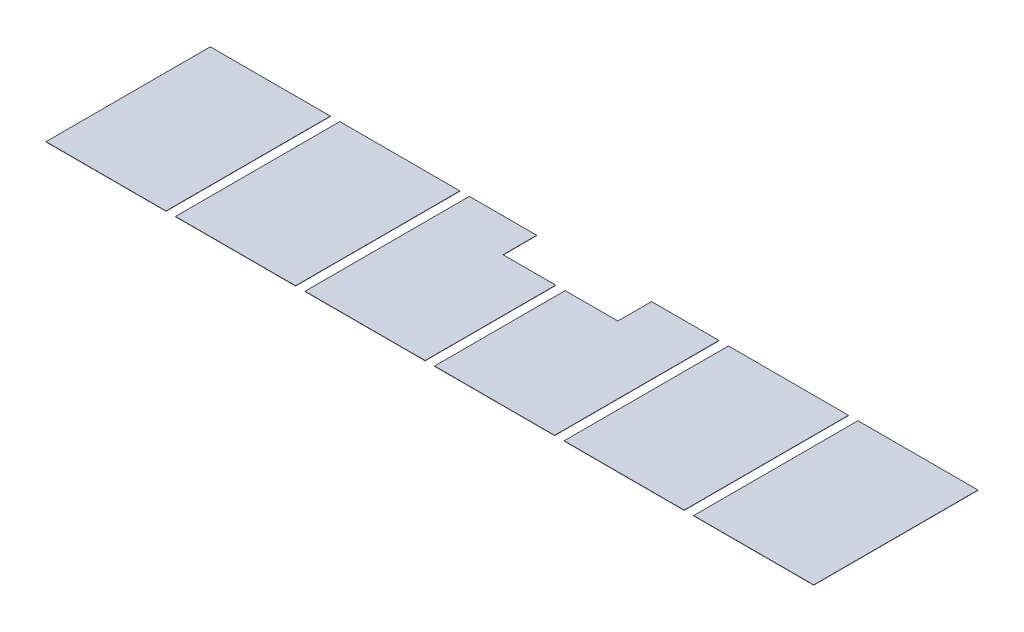
ISO-10303-21;
HEADER;
FILE_DESCRIPTION(('STEP AP214'),'2;1');
FILE_NAME('part.step','',(''),(''),'','','');
FILE_SCHEMA(('AUTOMOTIVE_DESIGN { 1 0 10303 214 1 1 1 1 }'));
ENDSEC;
DATA;
#1=APPLICATION_CONTEXT('core data for automotive mechanical design processes');
#2=APPLICATION_PROTOCOL_DEFINITION('international standard','automotive_design',2000,#1);
#3=PRODUCT_CONTEXT('',#1,'mechanical');
#4=PRODUCT('Part','Part','',(#3));
#5=PRODUCT_RELATED_PRODUCT_CATEGORY('part','',(#4));
#6=PRODUCT_DEFINITION_FORMATION('','',#4);
#7=PRODUCT_DEFINITION_CONTEXT('part definition',#1,'design');
#8=PRODUCT_DEFINITION('design','',#6,#7);
#9=PRODUCT_DEFINITION_SHAPE('','',#8);
#10=(LENGTH_UNIT() NAMED_UNIT(*) SI_UNIT(.MILLI.,.METRE.));
#11=(NAMED_UNIT(*) PLANE_ANGLE_UNIT() SI_UNIT($,.RADIAN.));
#12=(NAMED_UNIT(*) SI_UNIT($,.STERADIAN.) SOLID_ANGLE_UNIT());
#13=UNCERTAINTY_MEASURE_WITH_UNIT(LENGTH_MEASURE(1.E-05),#10,'distance_accuracy_value','');
#14=(GEOMETRIC_REPRESENTATION_CONTEXT(3) GLOBAL_UNCERTAINTY_ASSIGNED_CONTEXT((#13)) GLOBAL_UNIT_ASSIGNED_CONTEXT((#10,
#11,#12)) REPRESENTATION_CONTEXT('',''));
#15=CARTESIAN_POINT('',(0.,0.,0.));
#16=DIRECTION('',(0.,0.,1.));
#17=DIRECTION('',(1.,0.,0.));
#18=AXIS2_PLACEMENT_3D('',#15,#16,#17);
#19=CARTESIAN_POINT('',(4000.5,2497.64430946714,-2044.7));
#20=DIRECTION('',(0.,0.,1.));
#21=DIRECTION('',(1.,0.,0.));
#22=AXIS2_PLACEMENT_3D('',#19,#20,#21);
#23=PLANE('',#22);
#24=DIRECTION('',(-1.,0.,0.));
#25=VECTOR('',#24,1.);
#26=CARTESIAN_POINT('',(4000.5,43.8149999999999,-2044.7));
#27=LINE('',#26,#25);
#28=CARTESIAN_POINT('',(4000.5,43.8149999999999,-2044.7));
#29=VERTEX_POINT('',#28);
#30=CARTESIAN_POINT('',(3187.7,43.8149999999999,-2044.7));
#31=VERTEX_POINT('',#30);
#32=EDGE_CURVE('E126',#29,#31,#27,.T.);
#33=ORIENTED_EDGE('',*,*,#32,.F.);
#34=DIRECTION('',(0.,-1.,0.));
#35=VECTOR('',#34,1.);
#36=CARTESIAN_POINT('',(4000.5,2497.64430946714,-2044.7));
#37=LINE('',#36,#35);
#38=CARTESIAN_POINT('',(4000.5,40.64,-2044.7));
#39=VERTEX_POINT('',#38);
#40=EDGE_CURVE('E49',#29,#39,#37,.T.);
#41=ORIENTED_EDGE('',*,*,#40,.T.);
#42=DIRECTION('',(-1.,0.,0.));
#43=VECTOR('',#42,1.);
#44=CARTESIAN_POINT('',(4000.5,40.64,-2044.7));
#45=LINE('',#44,#43);
#46=CARTESIAN_POINT('',(3187.7,40.64,-2044.7));
#47=VERTEX_POINT('',#46);
#48=EDGE_CURVE('E134',#39,#47,#45,.T.);
#49=ORIENTED_EDGE('',*,*,#48,.T.);
#50=DIRECTION('',(0.,-1.,0.));
#51=VECTOR('',#50,1.);
#52=CARTESIAN_POINT('',(3187.7,2497.64430946714,-2044.7));
#53=LINE('',#52,#51);
#54=EDGE_CURVE('E92',#31,#47,#53,.T.);
#55=ORIENTED_EDGE('',*,*,#54,.F.);
#56=EDGE_LOOP('',(#33,#41,#49,#55));
#57=FACE_BOUND('',#56,.T.);
#58=ADVANCED_FACE('F45',(#57),#23,.F.);
#59=CARTESIAN_POINT('',(3187.7,2497.64430946714,-2044.7));
#60=DIRECTION('',(1.,0.,0.));
#61=DIRECTION('',(0.,0.,-1.));
#62=AXIS2_PLACEMENT_3D('',#59,#60,#61);
#63=PLANE('',#62);
#64=DIRECTION('',(0.,0.,1.));
#65=VECTOR('',#64,1.);
#66=CARTESIAN_POINT('',(3187.7,43.8149999999999,-2044.7));
#67=LINE('',#66,#65);
#68=CARTESIAN_POINT('',(3187.7,43.8149999999999,-63.5000000000028));
#69=VERTEX_POINT('',#68);
#70=EDGE_CURVE('E99',#31,#69,#67,.T.);
#71=ORIENTED_EDGE('',*,*,#70,.F.);
#72=ORIENTED_EDGE('',*,*,#54,.T.);
#73=DIRECTION('',(0.,0.,1.));
#74=VECTOR('',#73,1.);
#75=CARTESIAN_POINT('',(3187.7,40.64,-2044.7));
#76=LINE('',#75,#74);
#77=CARTESIAN_POINT('',(3187.7,40.64,-63.5000000000028));
#78=VERTEX_POINT('',#77);
#79=EDGE_CURVE('E133',#47,#78,#76,.T.);
#80=ORIENTED_EDGE('',*,*,#79,.T.);
#81=DIRECTION('',(0.,-1.,0.));
#82=VECTOR('',#81,1.);
#83=CARTESIAN_POINT('',(3187.7,2497.64430946714,-63.5000000000028));
#84=LINE('',#83,#82);
#85=EDGE_CURVE('E135',#69,#78,#84,.T.);
#86=ORIENTED_EDGE('',*,*,#85,.F.);
#87=EDGE_LOOP('',(#71,#72,#80,#86));
#88=FACE_BOUND('',#87,.T.);
#89=ADVANCED_FACE('F153',(#88),#63,.F.);
#90=CARTESIAN_POINT('',(3187.7,2497.64430946714,-63.5000000000028));
#91=DIRECTION('',(0.,0.,-1.));
#92=DIRECTION('',(-1.,0.,0.));
#93=AXIS2_PLACEMENT_3D('',#90,#91,#92);
#94=PLANE('',#93);
#95=DIRECTION('',(1.,0.,0.));
#96=VECTOR('',#95,1.);
#97=CARTESIAN_POINT('',(3187.7,43.8149999999999,-63.5000000000028));
#98=LINE('',#97,#96);
#99=CARTESIAN_POINT('',(4635.5,43.8149999999999,-63.5000000000028));
#100=VERTEX_POINT('',#99);
#101=EDGE_CURVE('E120',#69,#100,#98,.T.);
#102=ORIENTED_EDGE('',*,*,#101,.F.);
#103=ORIENTED_EDGE('',*,*,#85,.T.);
#104=DIRECTION('',(1.,0.,0.));
#105=VECTOR('',#104,1.);
#106=CARTESIAN_POINT('',(3187.7,40.64,-63.5000000000028));
#107=LINE('',#106,#105);
#108=CARTESIAN_POINT('',(4635.5,40.64,-63.5000000000028));
#109=VERTEX_POINT('',#108);
#110=EDGE_CURVE('E137',#78,#109,#107,.T.);
#111=ORIENTED_EDGE('',*,*,#110,.T.);
#112=DIRECTION('',(0.,-1.,0.));
#113=VECTOR('',#112,1.);
#114=CARTESIAN_POINT('',(4635.5,2497.64430946714,-63.5000000000028));
#115=LINE('',#114,#113);
#116=EDGE_CURVE('E138',#100,#109,#115,.T.);
#117=ORIENTED_EDGE('',*,*,#116,.F.);
#118=EDGE_LOOP('',(#102,#103,#111,#117));
#119=FACE_BOUND('',#118,.T.);
#120=ADVANCED_FACE('F155',(#119),#94,.F.);
#121=CARTESIAN_POINT('',(4635.5,2497.64430946714,-63.5000000000028));
#122=DIRECTION('',(-1.,0.,0.));
#123=DIRECTION('',(0.,0.,1.));
#124=AXIS2_PLACEMENT_3D('',#121,#122,#123);
#125=PLANE('',#124);
#126=DIRECTION('',(0.,0.,-1.));
#127=VECTOR('',#126,1.);
#128=CARTESIAN_POINT('',(4635.5,43.8149999999999,-63.5000000000028));
#129=LINE('',#128,#127);
#130=CARTESIAN_POINT('',(4635.5,43.8149999999999,-1638.3));
#131=VERTEX_POINT('',#130);
#132=EDGE_CURVE('E54',#100,#131,#129,.T.);
#133=ORIENTED_EDGE('',*,*,#132,.F.);
#134=ORIENTED_EDGE('',*,*,#116,.T.);
#135=DIRECTION('',(0.,0.,-1.));
#136=VECTOR('',#135,1.);
#137=CARTESIAN_POINT('',(4635.5,40.64,-63.5000000000028));
#138=LINE('',#137,#136);
#139=CARTESIAN_POINT('',(4635.5,40.64,-1638.3));
#140=VERTEX_POINT('',#139);
#141=EDGE_CURVE('E115',#109,#140,#138,.T.);
#142=ORIENTED_EDGE('',*,*,#141,.T.);
#143=DIRECTION('',(0.,-1.,0.));
#144=VECTOR('',#143,1.);
#145=CARTESIAN_POINT('',(4635.5,2497.64430946714,-1638.3));
#146=LINE('',#145,#144);
#147=EDGE_CURVE('E106',#131,#140,#146,.T.);
#148=ORIENTED_EDGE('',*,*,#147,.F.);
#149=EDGE_LOOP('',(#133,#134,#142,#148));
#150=FACE_BOUND('',#149,.T.);
#151=ADVANCED_FACE('F112',(#150),#125,.F.);
#152=CARTESIAN_POINT('',(4635.5,2497.64430946714,-1638.3));
#153=DIRECTION('',(0.,0.,1.));
#154=DIRECTION('',(1.,0.,0.));
#155=AXIS2_PLACEMENT_3D('',#152,#153,#154);
#156=PLANE('',#155);
#157=DIRECTION('',(-1.,0.,0.));
#158=VECTOR('',#157,1.);
#159=CARTESIAN_POINT('',(4635.5,43.8149999999999,-1638.3));
#160=LINE('',#159,#158);
#161=CARTESIAN_POINT('',(4000.5,43.8149999999999,-1638.3));
#162=VERTEX_POINT('',#161);
#163=EDGE_CURVE('E12',#131,#162,#160,.T.);
#164=ORIENTED_EDGE('',*,*,#163,.F.);
#165=ORIENTED_EDGE('',*,*,#147,.T.);
#166=DIRECTION('',(-1.,0.,0.));
#167=VECTOR('',#166,1.);
#168=CARTESIAN_POINT('',(4635.5,40.64,-1638.3));
#169=LINE('',#168,#167);
#170=CARTESIAN_POINT('',(4000.5,40.64,-1638.3));
#171=VERTEX_POINT('',#170);
#172=EDGE_CURVE('E117',#140,#171,#169,.T.);
#173=ORIENTED_EDGE('',*,*,#172,.T.);
#174=DIRECTION('',(0.,-1.,0.));
#175=VECTOR('',#174,1.);
#176=CARTESIAN_POINT('',(4000.5,2497.64430946714,-1638.3));
#177=LINE('',#176,#175);
#178=EDGE_CURVE('E67',#162,#171,#177,.T.);
#179=ORIENTED_EDGE('',*,*,#178,.F.);
#180=EDGE_LOOP('',(#164,#165,#173,#179));
#181=FACE_BOUND('',#180,.T.);
#182=ADVANCED_FACE('F105',(#181),#156,.F.);
#183=CARTESIAN_POINT('',(4000.5,2497.64430946714,-1638.3));
#184=DIRECTION('',(-1.,0.,0.));
#185=DIRECTION('',(0.,0.,1.));
#186=AXIS2_PLACEMENT_3D('',#183,#184,#185);
#187=PLANE('',#186);
#188=DIRECTION('',(0.,0.,-1.));
#189=VECTOR('',#188,1.);
#190=CARTESIAN_POINT('',(4000.5,43.8149999999999,-1638.3));
#191=LINE('',#190,#189);
#192=EDGE_CURVE('E129',#162,#29,#191,.T.);
#193=ORIENTED_EDGE('',*,*,#192,.F.);
#194=ORIENTED_EDGE('',*,*,#178,.T.);
#195=DIRECTION('',(0.,0.,-1.));
#196=VECTOR('',#195,1.);
#197=CARTESIAN_POINT('',(4000.5,40.64,-1638.3));
#198=LINE('',#197,#196);
#199=EDGE_CURVE('E131',#171,#39,#198,.T.);
#200=ORIENTED_EDGE('',*,*,#199,.T.);
#201=ORIENTED_EDGE('',*,*,#40,.F.);
#202=EDGE_LOOP('',(#193,#194,#200,#201));
#203=FACE_BOUND('',#202,.T.);
#204=ADVANCED_FACE('F149',(#203),#187,.F.);
#205=CARTESIAN_POINT('',(0.,40.64,0.));
#206=DIRECTION('',(0.,1.,0.));
#207=DIRECTION('',(0.,0.,1.));
#208=AXIS2_PLACEMENT_3D('',#205,#206,#207);
#209=PLANE('',#208);
#210=ORIENTED_EDGE('',*,*,#48,.F.);
#211=ORIENTED_EDGE('',*,*,#199,.F.);
#212=ORIENTED_EDGE('',*,*,#172,.F.);
#213=ORIENTED_EDGE('',*,*,#141,.F.);
#214=ORIENTED_EDGE('',*,*,#110,.F.);
#215=ORIENTED_EDGE('',*,*,#79,.F.);
#216=EDGE_LOOP('',(#210,#211,#212,#213,#214,#215));
#217=FACE_BOUND('',#216,.T.);
#218=ADVANCED_FACE('F151',(#217),#209,.F.);
#219=CARTESIAN_POINT('',(0.,43.815,0.));
#220=DIRECTION('',(0.,1.,0.));
#221=DIRECTION('',(0.,0.,1.));
#222=AXIS2_PLACEMENT_3D('',#219,#220,#221);
#223=PLANE('',#222);
#224=ORIENTED_EDGE('',*,*,#192,.T.);
#225=ORIENTED_EDGE('',*,*,#32,.T.);
#226=ORIENTED_EDGE('',*,*,#70,.T.);
#227=ORIENTED_EDGE('',*,*,#101,.T.);
#228=ORIENTED_EDGE('',*,*,#132,.T.);
#229=ORIENTED_EDGE('',*,*,#163,.T.);
#230=EDGE_LOOP('',(#224,#225,#226,#227,#228,#229));
#231=FACE_BOUND('',#230,.T.);
#232=ADVANCED_FACE('F47',(#231),#223,.T.);
#233=CLOSED_SHELL('',(#58,#89,#120,#151,#182,#204,#218,#232));
#234=MANIFOLD_SOLID_BREP('B2',#233);
#235=CARTESIAN_POINT('',(6197.6,2497.64430946714,-63.5000000000028));
#236=DIRECTION('',(-1.,0.,0.));
#237=DIRECTION('',(0.,0.,1.));
#238=AXIS2_PLACEMENT_3D('',#235,#236,#237);
#239=PLANE('',#238);
#240=DIRECTION('',(0.,0.,-1.));
#241=VECTOR('',#240,1.);
#242=CARTESIAN_POINT('',(6197.6,43.8149999999999,-63.5000000000028));
#243=LINE('',#242,#241);
#244=CARTESIAN_POINT('',(6197.6,43.8149999999999,-63.5000000000028));
#245=VERTEX_POINT('',#244);
#246=CARTESIAN_POINT('',(6197.6,43.8149999999999,-2044.7));
#247=VERTEX_POINT('',#246);
#248=EDGE_CURVE('E311',#245,#247,#243,.T.);
#249=ORIENTED_EDGE('',*,*,#248,.F.);
#250=DIRECTION('',(0.,-1.,0.));
#251=VECTOR('',#250,1.);
#252=CARTESIAN_POINT('',(6197.6,2497.64430946714,-63.5000000000028));
#253=LINE('',#252,#251);
#254=CARTESIAN_POINT('',(6197.6,40.64,-63.5000000000028));
#255=VERTEX_POINT('',#254);
#256=EDGE_CURVE('E234',#245,#255,#253,.T.);
#257=ORIENTED_EDGE('',*,*,#256,.T.);
#258=DIRECTION('',(0.,0.,-1.));
#259=VECTOR('',#258,1.);
#260=CARTESIAN_POINT('',(6197.6,40.64,-63.5000000000028));
#261=LINE('',#260,#259);
#262=CARTESIAN_POINT('',(6197.6,40.64,-2044.7));
#263=VERTEX_POINT('',#262);
#264=EDGE_CURVE('E319',#255,#263,#261,.T.);
#265=ORIENTED_EDGE('',*,*,#264,.T.);
#266=DIRECTION('',(0.,-1.,0.));
#267=VECTOR('',#266,1.);
#268=CARTESIAN_POINT('',(6197.6,2497.64430946714,-2044.7));
#269=LINE('',#268,#267);
#270=EDGE_CURVE('E277',#247,#263,#269,.T.);
#271=ORIENTED_EDGE('',*,*,#270,.F.);
#272=EDGE_LOOP('',(#249,#257,#265,#271));
#273=FACE_BOUND('',#272,.T.);
#274=ADVANCED_FACE('F230',(#273),#239,.F.);
#275=CARTESIAN_POINT('',(6197.6,2497.64430946714,-2044.7));
#276=DIRECTION('',(0.,0.,1.));
#277=DIRECTION('',(1.,0.,0.));
#278=AXIS2_PLACEMENT_3D('',#275,#276,#277);
#279=PLANE('',#278);
#280=DIRECTION('',(-1.,0.,0.));
#281=VECTOR('',#280,1.);
#282=CARTESIAN_POINT('',(6197.6,43.8149999999999,-2044.7));
#283=LINE('',#282,#281);
#284=CARTESIAN_POINT('',(5384.8,43.8149999999999,-2044.7));
#285=VERTEX_POINT('',#284);
#286=EDGE_CURVE('E284',#247,#285,#283,.T.);
#287=ORIENTED_EDGE('',*,*,#286,.F.);
#288=ORIENTED_EDGE('',*,*,#270,.T.);
#289=DIRECTION('',(-1.,0.,0.));
#290=VECTOR('',#289,1.);
#291=CARTESIAN_POINT('',(6197.6,40.64,-2044.7));
#292=LINE('',#291,#290);
#293=CARTESIAN_POINT('',(5384.8,40.64,-2044.7));
#294=VERTEX_POINT('',#293);
#295=EDGE_CURVE('E318',#263,#294,#292,.T.);
#296=ORIENTED_EDGE('',*,*,#295,.T.);
#297=DIRECTION('',(0.,-1.,0.));
#298=VECTOR('',#297,1.);
#299=CARTESIAN_POINT('',(5384.8,2497.64430946714,-2044.7));
#300=LINE('',#299,#298);
#301=EDGE_CURVE('E320',#285,#294,#300,.T.);
#302=ORIENTED_EDGE('',*,*,#301,.F.);
#303=EDGE_LOOP('',(#287,#288,#296,#302));
#304=FACE_BOUND('',#303,.T.);
#305=ADVANCED_FACE('F338',(#304),#279,.F.);
#306=CARTESIAN_POINT('',(5384.8,2497.64430946714,-2044.7));
#307=DIRECTION('',(1.,0.,0.));
#308=DIRECTION('',(0.,0.,-1.));
#309=AXIS2_PLACEMENT_3D('',#306,#307,#308);
#310=PLANE('',#309);
#311=DIRECTION('',(0.,0.,1.));
#312=VECTOR('',#311,1.);
#313=CARTESIAN_POINT('',(5384.8,43.8149999999999,-2044.7));
#314=LINE('',#313,#312);
#315=CARTESIAN_POINT('',(5384.8,43.8149999999999,-1638.3));
#316=VERTEX_POINT('',#315);
#317=EDGE_CURVE('E305',#285,#316,#314,.T.);
#318=ORIENTED_EDGE('',*,*,#317,.F.);
#319=ORIENTED_EDGE('',*,*,#301,.T.);
#320=DIRECTION('',(0.,0.,1.));
#321=VECTOR('',#320,1.);
#322=CARTESIAN_POINT('',(5384.8,40.64,-2044.7));
#323=LINE('',#322,#321);
#324=CARTESIAN_POINT('',(5384.8,40.64,-1638.3));
#325=VERTEX_POINT('',#324);
#326=EDGE_CURVE('E322',#294,#325,#323,.T.);
#327=ORIENTED_EDGE('',*,*,#326,.T.);
#328=DIRECTION('',(0.,-1.,0.));
#329=VECTOR('',#328,1.);
#330=CARTESIAN_POINT('',(5384.8,2497.64430946714,-1638.3));
#331=LINE('',#330,#329);
#332=EDGE_CURVE('E323',#316,#325,#331,.T.);
#333=ORIENTED_EDGE('',*,*,#332,.F.);
#334=EDGE_LOOP('',(#318,#319,#327,#333));
#335=FACE_BOUND('',#334,.T.);
#336=ADVANCED_FACE('F340',(#335),#310,.F.);
#337=CARTESIAN_POINT('',(5384.8,2497.64430946714,-1638.3));
#338=DIRECTION('',(0.,0.,1.));
#339=DIRECTION('',(1.,0.,0.));
#340=AXIS2_PLACEMENT_3D('',#337,#338,#339);
#341=PLANE('',#340);
#342=DIRECTION('',(-1.,0.,0.));
#343=VECTOR('',#342,1.);
#344=CARTESIAN_POINT('',(5384.8,43.8149999999999,-1638.3));
#345=LINE('',#344,#343);
#346=CARTESIAN_POINT('',(4749.8,43.8149999999999,-1638.3));
#347=VERTEX_POINT('',#346);
#348=EDGE_CURVE('E239',#316,#347,#345,.T.);
#349=ORIENTED_EDGE('',*,*,#348,.F.);
#350=ORIENTED_EDGE('',*,*,#332,.T.);
#351=DIRECTION('',(-1.,0.,0.));
#352=VECTOR('',#351,1.);
#353=CARTESIAN_POINT('',(5384.8,40.64,-1638.3));
#354=LINE('',#353,#352);
#355=CARTESIAN_POINT('',(4749.8,40.64,-1638.3));
#356=VERTEX_POINT('',#355);
#357=EDGE_CURVE('E300',#325,#356,#354,.T.);
#358=ORIENTED_EDGE('',*,*,#357,.T.);
#359=DIRECTION('',(0.,-1.,0.));
#360=VECTOR('',#359,1.);
#361=CARTESIAN_POINT('',(4749.8,2497.64430946714,-1638.3));
#362=LINE('',#361,#360);
#363=EDGE_CURVE('E291',#347,#356,#362,.T.);
#364=ORIENTED_EDGE('',*,*,#363,.F.);
#365=EDGE_LOOP('',(#349,#350,#358,#364));
#366=FACE_BOUND('',#365,.T.);
#367=ADVANCED_FACE('F297',(#366),#341,.F.);
#368=CARTESIAN_POINT('',(4749.8,2497.64430946714,-1638.3));
#369=DIRECTION('',(1.,0.,0.));
#370=DIRECTION('',(0.,0.,-1.));
#371=AXIS2_PLACEMENT_3D('',#368,#369,#370);
#372=PLANE('',#371);
#373=DIRECTION('',(0.,0.,1.));
#374=VECTOR('',#373,1.);
#375=CARTESIAN_POINT('',(4749.8,43.8149999999999,-1638.3));
#376=LINE('',#375,#374);
#377=CARTESIAN_POINT('',(4749.8,43.8149999999999,-63.5000000000028));
#378=VERTEX_POINT('',#377);
#379=EDGE_CURVE('E43',#347,#378,#376,.T.);
#380=ORIENTED_EDGE('',*,*,#379,.F.);
#381=ORIENTED_EDGE('',*,*,#363,.T.);
#382=DIRECTION('',(0.,0.,1.));
#383=VECTOR('',#382,1.);
#384=CARTESIAN_POINT('',(4749.8,40.64,-1638.3));
#385=LINE('',#384,#383);
#386=CARTESIAN_POINT('',(4749.8,40.64,-63.5000000000028));
#387=VERTEX_POINT('',#386);
#388=EDGE_CURVE('E302',#356,#387,#385,.T.);
#389=ORIENTED_EDGE('',*,*,#388,.T.);
#390=DIRECTION('',(0.,-1.,0.));
#391=VECTOR('',#390,1.);
#392=CARTESIAN_POINT('',(4749.8,2497.64430946714,-63.5000000000028));
#393=LINE('',#392,#391);
#394=EDGE_CURVE('E252',#378,#387,#393,.T.);
#395=ORIENTED_EDGE('',*,*,#394,.F.);
#396=EDGE_LOOP('',(#380,#381,#389,#395));
#397=FACE_BOUND('',#396,.T.);
#398=ADVANCED_FACE('F290',(#397),#372,.F.);
#399=CARTESIAN_POINT('',(4749.8,2497.64430946714,-63.5000000000028));
#400=DIRECTION('',(0.,0.,-1.));
#401=DIRECTION('',(-1.,0.,0.));
#402=AXIS2_PLACEMENT_3D('',#399,#400,#401);
#403=PLANE('',#402);
#404=DIRECTION('',(1.,0.,0.));
#405=VECTOR('',#404,1.);
#406=CARTESIAN_POINT('',(4749.8,43.8149999999999,-63.5000000000028));
#407=LINE('',#406,#405);
#408=EDGE_CURVE('E314',#378,#245,#407,.T.);
#409=ORIENTED_EDGE('',*,*,#408,.F.);
#410=ORIENTED_EDGE('',*,*,#394,.T.);
#411=DIRECTION('',(1.,0.,0.));
#412=VECTOR('',#411,1.);
#413=CARTESIAN_POINT('',(4749.8,40.64,-63.5000000000028));
#414=LINE('',#413,#412);
#415=EDGE_CURVE('E316',#387,#255,#414,.T.);
#416=ORIENTED_EDGE('',*,*,#415,.T.);
#417=ORIENTED_EDGE('',*,*,#256,.F.);
#418=EDGE_LOOP('',(#409,#410,#416,#417));
#419=FACE_BOUND('',#418,.T.);
#420=ADVANCED_FACE('F334',(#419),#403,.F.);
#421=CARTESIAN_POINT('',(0.,40.64,0.));
#422=DIRECTION('',(0.,1.,0.));
#423=DIRECTION('',(0.,0.,1.));
#424=AXIS2_PLACEMENT_3D('',#421,#422,#423);
#425=PLANE('',#424);
#426=ORIENTED_EDGE('',*,*,#264,.F.);
#427=ORIENTED_EDGE('',*,*,#415,.F.);
#428=ORIENTED_EDGE('',*,*,#388,.F.);
#429=ORIENTED_EDGE('',*,*,#357,.F.);
#430=ORIENTED_EDGE('',*,*,#326,.F.);
#431=ORIENTED_EDGE('',*,*,#295,.F.);
#432=EDGE_LOOP('',(#426,#427,#428,#429,#430,#431));
#433=FACE_BOUND('',#432,.T.);
#434=ADVANCED_FACE('F336',(#433),#425,.F.);
#435=CARTESIAN_POINT('',(0.,43.815,0.));
#436=DIRECTION('',(0.,1.,0.));
#437=DIRECTION('',(0.,0.,1.));
#438=AXIS2_PLACEMENT_3D('',#435,#436,#437);
#439=PLANE('',#438);
#440=ORIENTED_EDGE('',*,*,#408,.T.);
#441=ORIENTED_EDGE('',*,*,#248,.T.);
#442=ORIENTED_EDGE('',*,*,#286,.T.);
#443=ORIENTED_EDGE('',*,*,#317,.T.);
#444=ORIENTED_EDGE('',*,*,#348,.T.);
#445=ORIENTED_EDGE('',*,*,#379,.T.);
#446=EDGE_LOOP('',(#440,#441,#442,#443,#444,#445));
#447=FACE_BOUND('',#446,.T.);
#448=ADVANCED_FACE('F232',(#447),#439,.T.);
#449=CLOSED_SHELL('',(#274,#305,#336,#367,#398,#420,#434,#448));
#450=MANIFOLD_SOLID_BREP('B6',#449);
#451=CARTESIAN_POINT('',(6311.9,2497.64430946714,-63.5000000000028));
#452=DIRECTION('',(0.,0.,-1.));
#453=DIRECTION('',(-1.,0.,0.));
#454=AXIS2_PLACEMENT_3D('',#451,#452,#453);
#455=PLANE('',#454);
#456=DIRECTION('',(1.,0.,0.));
#457=VECTOR('',#456,1.);
#458=CARTESIAN_POINT('',(6311.9,43.8149999999999,-63.5000000000028));
#459=LINE('',#458,#457);
#460=CARTESIAN_POINT('',(6311.9,43.8149999999999,-63.5000000000028));
#461=VERTEX_POINT('',#460);
#462=CARTESIAN_POINT('',(7759.7,43.8149999999999,-63.5000000000028));
#463=VERTEX_POINT('',#462);
#464=EDGE_CURVE('E465',#461,#463,#459,.T.);
#465=ORIENTED_EDGE('',*,*,#464,.F.);
#466=DIRECTION('',(0.,-1.,0.));
#467=VECTOR('',#466,1.);
#468=CARTESIAN_POINT('',(6311.9,2497.64430946714,-63.5000000000028));
#469=LINE('',#468,#467);
#470=CARTESIAN_POINT('',(6311.9,40.64,-63.5000000000028));
#471=VERTEX_POINT('',#470);
#472=EDGE_CURVE('E419',#461,#471,#469,.T.);
#473=ORIENTED_EDGE('',*,*,#472,.T.);
#474=DIRECTION('',(1.,0.,0.));
#475=VECTOR('',#474,1.);
#476=CARTESIAN_POINT('',(6311.9,40.64,-63.5000000000028));
#477=LINE('',#476,#475);
#478=CARTESIAN_POINT('',(7759.7,40.64,-63.5000000000028));
#479=VERTEX_POINT('',#478);
#480=EDGE_CURVE('E463',#471,#479,#477,.T.);
#481=ORIENTED_EDGE('',*,*,#480,.T.);
#482=DIRECTION('',(0.,-1.,0.));
#483=VECTOR('',#482,1.);
#484=CARTESIAN_POINT('',(7759.7,2497.64430946714,-63.5000000000028));
#485=LINE('',#484,#483);
#486=EDGE_CURVE('E454',#463,#479,#485,.T.);
#487=ORIENTED_EDGE('',*,*,#486,.F.);
#488=EDGE_LOOP('',(#465,#473,#481,#487));
#489=FACE_BOUND('',#488,.T.);
#490=ADVANCED_FACE('F415',(#489),#455,.F.);
#491=CARTESIAN_POINT('',(7759.7,2497.64430946714,-63.5000000000028));
#492=DIRECTION('',(-1.,0.,0.));
#493=DIRECTION('',(0.,0.,1.));
#494=AXIS2_PLACEMENT_3D('',#491,#492,#493);
#495=PLANE('',#494);
#496=DIRECTION('',(0.,0.,-1.));
#497=VECTOR('',#496,1.);
#498=CARTESIAN_POINT('',(7759.7,43.8149999999999,-63.5000000000028));
#499=LINE('',#498,#497);
#500=CARTESIAN_POINT('',(7759.7,43.8149999999999,-2044.7));
#501=VERTEX_POINT('',#500);
#502=EDGE_CURVE('E424',#463,#501,#499,.T.);
#503=ORIENTED_EDGE('',*,*,#502,.F.);
#504=ORIENTED_EDGE('',*,*,#486,.T.);
#505=DIRECTION('',(0.,0.,-1.));
#506=VECTOR('',#505,1.);
#507=CARTESIAN_POINT('',(7759.7,40.64,-63.5000000000028));
#508=LINE('',#507,#506);
#509=CARTESIAN_POINT('',(7759.7,40.64,-2044.7));
#510=VERTEX_POINT('',#509);
#511=EDGE_CURVE('E475',#479,#510,#508,.T.);
#512=ORIENTED_EDGE('',*,*,#511,.T.);
#513=DIRECTION('',(0.,-1.,0.));
#514=VECTOR('',#513,1.);
#515=CARTESIAN_POINT('',(7759.7,2497.64430946714,-2044.7));
#516=LINE('',#515,#514);
#517=EDGE_CURVE('E484',#501,#510,#516,.T.);
#518=ORIENTED_EDGE('',*,*,#517,.F.);
#519=EDGE_LOOP('',(#503,#504,#512,#518));
#520=FACE_BOUND('',#519,.T.);
#521=ADVANCED_FACE('F488',(#520),#495,.F.);
#522=CARTESIAN_POINT('',(7759.7,2497.64430946714,-2044.7));
#523=DIRECTION('',(0.,0.,1.));
#524=DIRECTION('',(1.,0.,0.));
#525=AXIS2_PLACEMENT_3D('',#522,#523,#524);
#526=PLANE('',#525);
#527=DIRECTION('',(-1.,0.,0.));
#528=VECTOR('',#527,1.);
#529=CARTESIAN_POINT('',(7759.7,43.8149999999999,-2044.7));
#530=LINE('',#529,#528);
#531=CARTESIAN_POINT('',(6311.9,43.8149999999999,-2044.7));
#532=VERTEX_POINT('',#531);
#533=EDGE_CURVE('E228',#501,#532,#530,.T.);
#534=ORIENTED_EDGE('',*,*,#533,.F.);
#535=ORIENTED_EDGE('',*,*,#517,.T.);
#536=DIRECTION('',(-1.,0.,0.));
#537=VECTOR('',#536,1.);
#538=CARTESIAN_POINT('',(7759.7,40.64,-2044.7));
#539=LINE('',#538,#537);
#540=CARTESIAN_POINT('',(6311.9,40.64,-2044.7));
#541=VERTEX_POINT('',#540);
#542=EDGE_CURVE('E485',#510,#541,#539,.T.);
#543=ORIENTED_EDGE('',*,*,#542,.T.);
#544=DIRECTION('',(0.,-1.,0.));
#545=VECTOR('',#544,1.);
#546=CARTESIAN_POINT('',(6311.9,2497.64430946714,-2044.7));
#547=LINE('',#546,#545);
#548=EDGE_CURVE('E437',#532,#541,#547,.T.);
#549=ORIENTED_EDGE('',*,*,#548,.F.);
#550=EDGE_LOOP('',(#534,#535,#543,#549));
#551=FACE_BOUND('',#550,.T.);
#552=ADVANCED_FACE('F487',(#551),#526,.F.);
#553=CARTESIAN_POINT('',(6311.9,2497.64430946714,-2044.7));
#554=DIRECTION('',(1.,0.,0.));
#555=DIRECTION('',(0.,0.,-1.));
#556=AXIS2_PLACEMENT_3D('',#553,#554,#555);
#557=PLANE('',#556);
#558=DIRECTION('',(0.,0.,1.));
#559=VECTOR('',#558,1.);
#560=CARTESIAN_POINT('',(6311.9,43.8149999999999,-2044.7));
#561=LINE('',#560,#559);
#562=EDGE_CURVE('E472',#532,#461,#561,.T.);
#563=ORIENTED_EDGE('',*,*,#562,.F.);
#564=ORIENTED_EDGE('',*,*,#548,.T.);
#565=DIRECTION('',(0.,0.,1.));
#566=VECTOR('',#565,1.);
#567=CARTESIAN_POINT('',(6311.9,40.64,-2044.7));
#568=LINE('',#567,#566);
#569=EDGE_CURVE('E468',#541,#471,#568,.T.);
#570=ORIENTED_EDGE('',*,*,#569,.T.);
#571=ORIENTED_EDGE('',*,*,#472,.F.);
#572=EDGE_LOOP('',(#563,#564,#570,#571));
#573=FACE_BOUND('',#572,.T.);
#574=ADVANCED_FACE('F469',(#573),#557,.F.);
#575=CARTESIAN_POINT('',(0.,40.64,0.));
#576=DIRECTION('',(0.,1.,0.));
#577=DIRECTION('',(0.,0.,1.));
#578=AXIS2_PLACEMENT_3D('',#575,#576,#577);
#579=PLANE('',#578);
#580=ORIENTED_EDGE('',*,*,#480,.F.);
#581=ORIENTED_EDGE('',*,*,#569,.F.);
#582=ORIENTED_EDGE('',*,*,#542,.F.);
#583=ORIENTED_EDGE('',*,*,#511,.F.);
#584=EDGE_LOOP('',(#580,#581,#582,#583));
#585=FACE_BOUND('',#584,.T.);
#586=ADVANCED_FACE('F474',(#585),#579,.F.);
#587=CARTESIAN_POINT('',(0.,43.815,0.));
#588=DIRECTION('',(0.,1.,0.));
#589=DIRECTION('',(0.,0.,1.));
#590=AXIS2_PLACEMENT_3D('',#587,#588,#589);
#591=PLANE('',#590);
#592=ORIENTED_EDGE('',*,*,#562,.T.);
#593=ORIENTED_EDGE('',*,*,#464,.T.);
#594=ORIENTED_EDGE('',*,*,#502,.T.);
#595=ORIENTED_EDGE('',*,*,#533,.T.);
#596=EDGE_LOOP('',(#592,#593,#594,#595));
#597=FACE_BOUND('',#596,.T.);
#598=ADVANCED_FACE('F417',(#597),#591,.T.);
#599=CLOSED_SHELL('',(#490,#521,#552,#574,#586,#598));
#600=MANIFOLD_SOLID_BREP('B37',#599);
#601=CARTESIAN_POINT('',(9321.8,2497.64430946714,-63.5000000000028));
#602=DIRECTION('',(-1.,0.,0.));
#603=DIRECTION('',(0.,0.,1.));
#604=AXIS2_PLACEMENT_3D('',#601,#602,#603);
#605=PLANE('',#604);
#606=DIRECTION('',(0.,0.,-1.));
#607=VECTOR('',#606,1.);
#608=CARTESIAN_POINT('',(9321.8,43.8149999999999,-63.5000000000028));
#609=LINE('',#608,#607);
#610=CARTESIAN_POINT('',(9321.8,43.8149999999999,-63.5000000000028));
#611=VERTEX_POINT('',#610);
#612=CARTESIAN_POINT('',(9321.8,43.8149999999999,-2044.7));
#613=VERTEX_POINT('',#612);
#614=EDGE_CURVE('E598',#611,#613,#609,.T.);
#615=ORIENTED_EDGE('',*,*,#614,.F.);
#616=DIRECTION('',(0.,-1.,0.));
#617=VECTOR('',#616,1.);
#618=CARTESIAN_POINT('',(9321.8,2497.64430946714,-63.5000000000028));
#619=LINE('',#618,#617);
#620=CARTESIAN_POINT('',(9321.8,40.64,-63.5000000000028));
#621=VERTEX_POINT('',#620);
#622=EDGE_CURVE('E552',#611,#621,#619,.T.);
#623=ORIENTED_EDGE('',*,*,#622,.T.);
#624=DIRECTION('',(0.,0.,-1.));
#625=VECTOR('',#624,1.);
#626=CARTESIAN_POINT('',(9321.8,40.64,-63.5000000000028));
#627=LINE('',#626,#625);
#628=CARTESIAN_POINT('',(9321.8,40.64,-2044.7));
#629=VERTEX_POINT('',#628);
#630=EDGE_CURVE('E596',#621,#629,#627,.T.);
#631=ORIENTED_EDGE('',*,*,#630,.T.);
#632=DIRECTION('',(0.,-1.,0.));
#633=VECTOR('',#632,1.);
#634=CARTESIAN_POINT('',(9321.8,2497.64430946714,-2044.7));
#635=LINE('',#634,#633);
#636=EDGE_CURVE('E587',#613,#629,#635,.T.);
#637=ORIENTED_EDGE('',*,*,#636,.F.);
#638=EDGE_LOOP('',(#615,#623,#631,#637));
#639=FACE_BOUND('',#638,.T.);
#640=ADVANCED_FACE('F548',(#639),#605,.F.);
#641=CARTESIAN_POINT('',(9321.8,2497.64430946714,-2044.7));
#642=DIRECTION('',(0.,0.,1.));
#643=DIRECTION('',(1.,0.,0.));
#644=AXIS2_PLACEMENT_3D('',#641,#642,#643);
#645=PLANE('',#644);
#646=DIRECTION('',(-1.,0.,0.));
#647=VECTOR('',#646,1.);
#648=CARTESIAN_POINT('',(9321.8,43.8149999999999,-2044.7));
#649=LINE('',#648,#647);
#650=CARTESIAN_POINT('',(7874.,43.8149999999999,-2044.7));
#651=VERTEX_POINT('',#650);
#652=EDGE_CURVE('E557',#613,#651,#649,.T.);
#653=ORIENTED_EDGE('',*,*,#652,.F.);
#654=ORIENTED_EDGE('',*,*,#636,.T.);
#655=DIRECTION('',(-1.,0.,0.));
#656=VECTOR('',#655,1.);
#657=CARTESIAN_POINT('',(9321.8,40.64,-2044.7));
#658=LINE('',#657,#656);
#659=CARTESIAN_POINT('',(7874.,40.64,-2044.7));
#660=VERTEX_POINT('',#659);
#661=EDGE_CURVE('E608',#629,#660,#658,.T.);
#662=ORIENTED_EDGE('',*,*,#661,.T.);
#663=DIRECTION('',(0.,-1.,0.));
#664=VECTOR('',#663,1.);
#665=CARTESIAN_POINT('',(7874.,2497.64430946714,-2044.7));
#666=LINE('',#665,#664);
#667=EDGE_CURVE('E617',#651,#660,#666,.T.);
#668=ORIENTED_EDGE('',*,*,#667,.F.);
#669=EDGE_LOOP('',(#653,#654,#662,#668));
#670=FACE_BOUND('',#669,.T.);
#671=ADVANCED_FACE('F621',(#670),#645,.F.);
#672=CARTESIAN_POINT('',(7874.,2497.64430946714,-2044.7));
#673=DIRECTION('',(1.,0.,0.));
#674=DIRECTION('',(0.,0.,-1.));
#675=AXIS2_PLACEMENT_3D('',#672,#673,#674);
#676=PLANE('',#675);
#677=DIRECTION('',(0.,0.,1.));
#678=VECTOR('',#677,1.);
#679=CARTESIAN_POINT('',(7874.,43.8149999999999,-2044.7));
#680=LINE('',#679,#678);
#681=CARTESIAN_POINT('',(7874.,43.8149999999999,-63.5000000000028));
#682=VERTEX_POINT('',#681);
#683=EDGE_CURVE('E413',#651,#682,#680,.T.);
#684=ORIENTED_EDGE('',*,*,#683,.F.);
#685=ORIENTED_EDGE('',*,*,#667,.T.);
#686=DIRECTION('',(0.,0.,1.));
#687=VECTOR('',#686,1.);
#688=CARTESIAN_POINT('',(7874.,40.64,-2044.7));
#689=LINE('',#688,#687);
#690=CARTESIAN_POINT('',(7874.,40.64,-63.5000000000028));
#691=VERTEX_POINT('',#690);
#692=EDGE_CURVE('E618',#660,#691,#689,.T.);
#693=ORIENTED_EDGE('',*,*,#692,.T.);
#694=DIRECTION('',(0.,-1.,0.));
#695=VECTOR('',#694,1.);
#696=CARTESIAN_POINT('',(7874.,2497.64430946714,-63.5000000000028));
#697=LINE('',#696,#695);
#698=EDGE_CURVE('E570',#682,#691,#697,.T.);
#699=ORIENTED_EDGE('',*,*,#698,.F.);
#700=EDGE_LOOP('',(#684,#685,#693,#699));
#701=FACE_BOUND('',#700,.T.);
#702=ADVANCED_FACE('F620',(#701),#676,.F.);
#703=CARTESIAN_POINT('',(7874.,2497.64430946714,-63.5000000000028));
#704=DIRECTION('',(0.,0.,-1.));
#705=DIRECTION('',(-1.,0.,0.));
#706=AXIS2_PLACEMENT_3D('',#703,#704,#705);
#707=PLANE('',#706);
#708=DIRECTION('',(1.,0.,0.));
#709=VECTOR('',#708,1.);
#710=CARTESIAN_POINT('',(7874.,43.8149999999999,-63.5000000000028));
#711=LINE('',#710,#709);
#712=EDGE_CURVE('E605',#682,#611,#711,.T.);
#713=ORIENTED_EDGE('',*,*,#712,.F.);
#714=ORIENTED_EDGE('',*,*,#698,.T.);
#715=DIRECTION('',(1.,0.,0.));
#716=VECTOR('',#715,1.);
#717=CARTESIAN_POINT('',(7874.,40.64,-63.5000000000028));
#718=LINE('',#717,#716);
#719=EDGE_CURVE('E601',#691,#621,#718,.T.);
#720=ORIENTED_EDGE('',*,*,#719,.T.);
#721=ORIENTED_EDGE('',*,*,#622,.F.);
#722=EDGE_LOOP('',(#713,#714,#720,#721));
#723=FACE_BOUND('',#722,.T.);
#724=ADVANCED_FACE('F602',(#723),#707,.F.);
#725=CARTESIAN_POINT('',(0.,40.64,0.));
#726=DIRECTION('',(0.,1.,0.));
#727=DIRECTION('',(0.,0.,1.));
#728=AXIS2_PLACEMENT_3D('',#725,#726,#727);
#729=PLANE('',#728);
#730=ORIENTED_EDGE('',*,*,#630,.F.);
#731=ORIENTED_EDGE('',*,*,#719,.F.);
#732=ORIENTED_EDGE('',*,*,#692,.F.);
#733=ORIENTED_EDGE('',*,*,#661,.F.);
#734=EDGE_LOOP('',(#730,#731,#732,#733));
#735=FACE_BOUND('',#734,.T.);
#736=ADVANCED_FACE('F607',(#735),#729,.F.);
#737=CARTESIAN_POINT('',(0.,43.815,0.));
#738=DIRECTION('',(0.,1.,0.));
#739=DIRECTION('',(0.,0.,1.));
#740=AXIS2_PLACEMENT_3D('',#737,#738,#739);
#741=PLANE('',#740);
#742=ORIENTED_EDGE('',*,*,#712,.T.);
#743=ORIENTED_EDGE('',*,*,#614,.T.);
#744=ORIENTED_EDGE('',*,*,#652,.T.);
#745=ORIENTED_EDGE('',*,*,#683,.T.);
#746=EDGE_LOOP('',(#742,#743,#744,#745));
#747=FACE_BOUND('',#746,.T.);
#748=ADVANCED_FACE('F550',(#747),#741,.T.);
#749=CLOSED_SHELL('',(#640,#671,#702,#724,#736,#748));
#750=MANIFOLD_SOLID_BREP('B222',#749);
#751=CARTESIAN_POINT('',(1511.3,2497.64430946714,-63.5000000000029));
#752=DIRECTION('',(-1.,0.,0.));
#753=DIRECTION('',(0.,0.,1.));
#754=AXIS2_PLACEMENT_3D('',#751,#752,#753);
#755=PLANE('',#754);
#756=DIRECTION('',(0.,0.,-1.));
#757=VECTOR('',#756,1.);
#758=CARTESIAN_POINT('',(1511.3,43.8149999999999,-63.5000000000029));
#759=LINE('',#758,#757);
#760=CARTESIAN_POINT('',(1511.3,43.8149999999999,-63.5000000000029));
#761=VERTEX_POINT('',#760);
#762=CARTESIAN_POINT('',(1511.3,43.8149999999999,-2044.7));
#763=VERTEX_POINT('',#762);
#764=EDGE_CURVE('E730',#761,#763,#759,.T.);
#765=ORIENTED_EDGE('',*,*,#764,.F.);
#766=DIRECTION('',(0.,-1.,0.));
#767=VECTOR('',#766,1.);
#768=CARTESIAN_POINT('',(1511.3,2497.64430946714,-63.5000000000029));
#769=LINE('',#768,#767);
#770=CARTESIAN_POINT('',(1511.3,40.64,-63.5000000000029));
#771=VERTEX_POINT('',#770);
#772=EDGE_CURVE('E684',#761,#771,#769,.T.);
#773=ORIENTED_EDGE('',*,*,#772,.T.);
#774=DIRECTION('',(0.,0.,-1.));
#775=VECTOR('',#774,1.);
#776=CARTESIAN_POINT('',(1511.3,40.64,-63.5000000000029));
#777=LINE('',#776,#775);
#778=CARTESIAN_POINT('',(1511.3,40.64,-2044.7));
#779=VERTEX_POINT('',#778);
#780=EDGE_CURVE('E728',#771,#779,#777,.T.);
#781=ORIENTED_EDGE('',*,*,#780,.T.);
#782=DIRECTION('',(0.,-1.,0.));
#783=VECTOR('',#782,1.);
#784=CARTESIAN_POINT('',(1511.3,2497.64430946714,-2044.7));
#785=LINE('',#784,#783);
#786=EDGE_CURVE('E719',#763,#779,#785,.T.);
#787=ORIENTED_EDGE('',*,*,#786,.F.);
#788=EDGE_LOOP('',(#765,#773,#781,#787));
#789=FACE_BOUND('',#788,.T.);
#790=ADVANCED_FACE('F680',(#789),#755,.F.);
#791=CARTESIAN_POINT('',(1511.3,2497.64430946714,-2044.7));
#792=DIRECTION('',(0.,0.,1.));
#793=DIRECTION('',(1.,0.,0.));
#794=AXIS2_PLACEMENT_3D('',#791,#792,#793);
#795=PLANE('',#794);
#796=DIRECTION('',(-1.,0.,0.));
#797=VECTOR('',#796,1.);
#798=CARTESIAN_POINT('',(1511.3,43.8149999999999,-2044.7));
#799=LINE('',#798,#797);
#800=CARTESIAN_POINT('',(63.4999999999997,43.8149999999999,-2044.7));
#801=VERTEX_POINT('',#800);
#802=EDGE_CURVE('E689',#763,#801,#799,.T.);
#803=ORIENTED_EDGE('',*,*,#802,.F.);
#804=ORIENTED_EDGE('',*,*,#786,.T.);
#805=DIRECTION('',(-1.,0.,0.));
#806=VECTOR('',#805,1.);
#807=CARTESIAN_POINT('',(1511.3,40.64,-2044.7));
#808=LINE('',#807,#806);
#809=CARTESIAN_POINT('',(63.4999999999997,40.64,-2044.7));
#810=VERTEX_POINT('',#809);
#811=EDGE_CURVE('E740',#779,#810,#808,.T.);
#812=ORIENTED_EDGE('',*,*,#811,.T.);
#813=DIRECTION('',(0.,-1.,0.));
#814=VECTOR('',#813,1.);
#815=CARTESIAN_POINT('',(63.4999999999997,2497.64430946714,-2044.7));
#816=LINE('',#815,#814);
#817=EDGE_CURVE('E749',#801,#810,#816,.T.);
#818=ORIENTED_EDGE('',*,*,#817,.F.);
#819=EDGE_LOOP('',(#803,#804,#812,#818));
#820=FACE_BOUND('',#819,.T.);
#821=ADVANCED_FACE('F753',(#820),#795,.F.);
#822=CARTESIAN_POINT('',(63.4999999999997,2497.64430946714,-2044.7));
#823=DIRECTION('',(1.,0.,0.));
#824=DIRECTION('',(0.,0.,-1.));
#825=AXIS2_PLACEMENT_3D('',#822,#823,#824);
#826=PLANE('',#825);
#827=DIRECTION('',(0.,0.,1.));
#828=VECTOR('',#827,1.);
#829=CARTESIAN_POINT('',(63.4999999999997,43.8149999999999,-2044.7));
#830=LINE('',#829,#828);
#831=CARTESIAN_POINT('',(63.4999999999997,43.8149999999999,-63.500000000003));
#832=VERTEX_POINT('',#831);
#833=EDGE_CURVE('E546',#801,#832,#830,.T.);
#834=ORIENTED_EDGE('',*,*,#833,.F.);
#835=ORIENTED_EDGE('',*,*,#817,.T.);
#836=DIRECTION('',(0.,0.,1.));
#837=VECTOR('',#836,1.);
#838=CARTESIAN_POINT('',(63.4999999999997,40.64,-2044.7));
#839=LINE('',#838,#837);
#840=CARTESIAN_POINT('',(63.4999999999997,40.64,-63.500000000003));
#841=VERTEX_POINT('',#840);
#842=EDGE_CURVE('E750',#810,#841,#839,.T.);
#843=ORIENTED_EDGE('',*,*,#842,.T.);
#844=DIRECTION('',(0.,-1.,0.));
#845=VECTOR('',#844,1.);
#846=CARTESIAN_POINT('',(63.4999999999997,2497.64430946714,-63.500000000003));
#847=LINE('',#846,#845);
#848=EDGE_CURVE('E702',#832,#841,#847,.T.);
#849=ORIENTED_EDGE('',*,*,#848,.F.);
#850=EDGE_LOOP('',(#834,#835,#843,#849));
#851=FACE_BOUND('',#850,.T.);
#852=ADVANCED_FACE('F752',(#851),#826,.F.);
#853=CARTESIAN_POINT('',(63.4999999999997,2497.64430946714,-63.500000000003));
#854=DIRECTION('',(0.,0.,-1.));
#855=DIRECTION('',(-1.,0.,0.));
#856=AXIS2_PLACEMENT_3D('',#853,#854,#855);
#857=PLANE('',#856);
#858=DIRECTION('',(1.,0.,0.));
#859=VECTOR('',#858,1.);
#860=CARTESIAN_POINT('',(63.4999999999997,43.8149999999999,-63.500000000003));
#861=LINE('',#860,#859);
#862=EDGE_CURVE('E737',#832,#761,#861,.T.);
#863=ORIENTED_EDGE('',*,*,#862,.F.);
#864=ORIENTED_EDGE('',*,*,#848,.T.);
#865=DIRECTION('',(1.,0.,0.));
#866=VECTOR('',#865,1.);
#867=CARTESIAN_POINT('',(63.4999999999997,40.64,-63.500000000003));
#868=LINE('',#867,#866);
#869=EDGE_CURVE('E733',#841,#771,#868,.T.);
#870=ORIENTED_EDGE('',*,*,#869,.T.);
#871=ORIENTED_EDGE('',*,*,#772,.F.);
#872=EDGE_LOOP('',(#863,#864,#870,#871));
#873=FACE_BOUND('',#872,.T.);
#874=ADVANCED_FACE('F734',(#873),#857,.F.);
#875=CARTESIAN_POINT('',(0.,40.64,0.));
#876=DIRECTION('',(0.,1.,0.));
#877=DIRECTION('',(0.,0.,1.));
#878=AXIS2_PLACEMENT_3D('',#875,#876,#877);
#879=PLANE('',#878);
#880=ORIENTED_EDGE('',*,*,#780,.F.);
#881=ORIENTED_EDGE('',*,*,#869,.F.);
#882=ORIENTED_EDGE('',*,*,#842,.F.);
#883=ORIENTED_EDGE('',*,*,#811,.F.);
#884=EDGE_LOOP('',(#880,#881,#882,#883));
#885=FACE_BOUND('',#884,.T.);
#886=ADVANCED_FACE('F739',(#885),#879,.F.);
#887=CARTESIAN_POINT('',(0.,43.815,0.));
#888=DIRECTION('',(0.,1.,0.));
#889=DIRECTION('',(0.,0.,1.));
#890=AXIS2_PLACEMENT_3D('',#887,#888,#889);
#891=PLANE('',#890);
#892=ORIENTED_EDGE('',*,*,#862,.T.);
#893=ORIENTED_EDGE('',*,*,#764,.T.);
#894=ORIENTED_EDGE('',*,*,#802,.T.);
#895=ORIENTED_EDGE('',*,*,#833,.T.);
#896=EDGE_LOOP('',(#892,#893,#894,#895));
#897=FACE_BOUND('',#896,.T.);
#898=ADVANCED_FACE('F682',(#897),#891,.T.);
#899=CLOSED_SHELL('',(#790,#821,#852,#874,#886,#898));
#900=MANIFOLD_SOLID_BREP('B407',#899);
#901=CARTESIAN_POINT('',(3073.4,2497.64430946714,-63.5000000000028));
#902=DIRECTION('',(-1.,0.,0.));
#903=DIRECTION('',(0.,0.,1.));
#904=AXIS2_PLACEMENT_3D('',#901,#902,#903);
#905=PLANE('',#904);
#906=DIRECTION('',(0.,0.,-1.));
#907=VECTOR('',#906,1.);
#908=CARTESIAN_POINT('',(3073.4,43.8149999999999,-63.5000000000028));
#909=LINE('',#908,#907);
#910=CARTESIAN_POINT('',(3073.4,43.8149999999999,-63.5000000000028));
#911=VERTEX_POINT('',#910);
#912=CARTESIAN_POINT('',(3073.4,43.8149999999999,-2044.7));
#913=VERTEX_POINT('',#912);
#914=EDGE_CURVE('E853',#911,#913,#909,.T.);
#915=ORIENTED_EDGE('',*,*,#914,.F.);
#916=DIRECTION('',(0.,-1.,0.));
#917=VECTOR('',#916,1.);
#918=CARTESIAN_POINT('',(3073.4,2497.64430946714,-63.5000000000028));
#919=LINE('',#918,#917);
#920=CARTESIAN_POINT('',(3073.4,40.64,-63.5000000000028));
#921=VERTEX_POINT('',#920);
#922=EDGE_CURVE('E807',#911,#921,#919,.T.);
#923=ORIENTED_EDGE('',*,*,#922,.T.);
#924=DIRECTION('',(0.,0.,-1.));
#925=VECTOR('',#924,1.);
#926=CARTESIAN_POINT('',(3073.4,40.64,-63.5000000000028));
#927=LINE('',#926,#925);
#928=CARTESIAN_POINT('',(3073.4,40.64,-2044.7));
#929=VERTEX_POINT('',#928);
#930=EDGE_CURVE('E851',#921,#929,#927,.T.);
#931=ORIENTED_EDGE('',*,*,#930,.T.);
#932=DIRECTION('',(0.,-1.,0.));
#933=VECTOR('',#932,1.);
#934=CARTESIAN_POINT('',(3073.4,2497.64430946714,-2044.7));
#935=LINE('',#934,#933);
#936=EDGE_CURVE('E842',#913,#929,#935,.T.);
#937=ORIENTED_EDGE('',*,*,#936,.F.);
#938=EDGE_LOOP('',(#915,#923,#931,#937));
#939=FACE_BOUND('',#938,.T.);
#940=ADVANCED_FACE('F803',(#939),#905,.F.);
#941=CARTESIAN_POINT('',(3073.4,2497.64430946714,-2044.7));
#942=DIRECTION('',(0.,0.,1.));
#943=DIRECTION('',(1.,0.,0.));
#944=AXIS2_PLACEMENT_3D('',#941,#942,#943);
#945=PLANE('',#944);
#946=DIRECTION('',(-1.,0.,0.));
#947=VECTOR('',#946,1.);
#948=CARTESIAN_POINT('',(3073.4,43.8149999999999,-2044.7));
#949=LINE('',#948,#947);
#950=CARTESIAN_POINT('',(1625.6,43.8149999999999,-2044.7));
#951=VERTEX_POINT('',#950);
#952=EDGE_CURVE('E812',#913,#951,#949,.T.);
#953=ORIENTED_EDGE('',*,*,#952,.F.);
#954=ORIENTED_EDGE('',*,*,#936,.T.);
#955=DIRECTION('',(-1.,0.,0.));
#956=VECTOR('',#955,1.);
#957=CARTESIAN_POINT('',(3073.4,40.64,-2044.7));
#958=LINE('',#957,#956);
#959=CARTESIAN_POINT('',(1625.6,40.64,-2044.7));
#960=VERTEX_POINT('',#959);
#961=EDGE_CURVE('E863',#929,#960,#958,.T.);
#962=ORIENTED_EDGE('',*,*,#961,.T.);
#963=DIRECTION('',(0.,-1.,0.));
#964=VECTOR('',#963,1.);
#965=CARTESIAN_POINT('',(1625.6,2497.64430946714,-2044.7));
#966=LINE('',#965,#964);
#967=EDGE_CURVE('E872',#951,#960,#966,.T.);
#968=ORIENTED_EDGE('',*,*,#967,.F.);
#969=EDGE_LOOP('',(#953,#954,#962,#968));
#970=FACE_BOUND('',#969,.T.);
#971=ADVANCED_FACE('F876',(#970),#945,.F.);
#972=CARTESIAN_POINT('',(1625.6,2497.64430946714,-2044.7));
#973=DIRECTION('',(1.,0.,0.));
#974=DIRECTION('',(0.,0.,-1.));
#975=AXIS2_PLACEMENT_3D('',#972,#973,#974);
#976=PLANE('',#975);
#977=DIRECTION('',(0.,0.,1.));
#978=VECTOR('',#977,1.);
#979=CARTESIAN_POINT('',(1625.6,43.8149999999999,-2044.7));
#980=LINE('',#979,#978);
#981=CARTESIAN_POINT('',(1625.6,43.8149999999999,-63.5000000000028));
#982=VERTEX_POINT('',#981);
#983=EDGE_CURVE('E678',#951,#982,#980,.T.);
#984=ORIENTED_EDGE('',*,*,#983,.F.);
#985=ORIENTED_EDGE('',*,*,#967,.T.);
#986=DIRECTION('',(0.,0.,1.));
#987=VECTOR('',#986,1.);
#988=CARTESIAN_POINT('',(1625.6,40.64,-2044.7));
#989=LINE('',#988,#987);
#990=CARTESIAN_POINT('',(1625.6,40.64,-63.5000000000028));
#991=VERTEX_POINT('',#990);
#992=EDGE_CURVE('E873',#960,#991,#989,.T.);
#993=ORIENTED_EDGE('',*,*,#992,.T.);
#994=DIRECTION('',(0.,-1.,0.));
#995=VECTOR('',#994,1.);
#996=CARTESIAN_POINT('',(1625.6,2497.64430946714,-63.5000000000028));
#997=LINE('',#996,#995);
#998=EDGE_CURVE('E825',#982,#991,#997,.T.);
#999=ORIENTED_EDGE('',*,*,#998,.F.);
#1000=EDGE_LOOP('',(#984,#985,#993,#999));
#1001=FACE_BOUND('',#1000,.T.);
#1002=ADVANCED_FACE('F875',(#1001),#976,.F.);
#1003=CARTESIAN_POINT('',(1625.6,2497.64430946714,-63.5000000000028));
#1004=DIRECTION('',(0.,0.,-1.));
#1005=DIRECTION('',(-1.,0.,0.));
#1006=AXIS2_PLACEMENT_3D('',#1003,#1004,#1005);
#1007=PLANE('',#1006);
#1008=DIRECTION('',(1.,0.,0.));
#1009=VECTOR('',#1008,1.);
#1010=CARTESIAN_POINT('',(1625.6,43.8149999999999,-63.5000000000028));
#1011=LINE('',#1010,#1009);
#1012=EDGE_CURVE('E860',#982,#911,#1011,.T.);
#1013=ORIENTED_EDGE('',*,*,#1012,.F.);
#1014=ORIENTED_EDGE('',*,*,#998,.T.);
#1015=DIRECTION('',(1.,0.,0.));
#1016=VECTOR('',#1015,1.);
#1017=CARTESIAN_POINT('',(1625.6,40.64,-63.5000000000028));
#1018=LINE('',#1017,#1016);
#1019=EDGE_CURVE('E856',#991,#921,#1018,.T.);
#1020=ORIENTED_EDGE('',*,*,#1019,.T.);
#1021=ORIENTED_EDGE('',*,*,#922,.F.);
#1022=EDGE_LOOP('',(#1013,#1014,#1020,#1021));
#1023=FACE_BOUND('',#1022,.T.);
#1024=ADVANCED_FACE('F857',(#1023),#1007,.F.);
#1025=CARTESIAN_POINT('',(0.,40.64,0.));
#1026=DIRECTION('',(0.,1.,0.));
#1027=DIRECTION('',(0.,0.,1.));
#1028=AXIS2_PLACEMENT_3D('',#1025,#1026,#1027);
#1029=PLANE('',#1028);
#1030=ORIENTED_EDGE('',*,*,#930,.F.);
#1031=ORIENTED_EDGE('',*,*,#1019,.F.);
#1032=ORIENTED_EDGE('',*,*,#992,.F.);
#1033=ORIENTED_EDGE('',*,*,#961,.F.);
#1034=EDGE_LOOP('',(#1030,#1031,#1032,#1033));
#1035=FACE_BOUND('',#1034,.T.);
#1036=ADVANCED_FACE('F862',(#1035),#1029,.F.);
#1037=CARTESIAN_POINT('',(0.,43.815,0.));
#1038=DIRECTION('',(0.,1.,0.));
#1039=DIRECTION('',(0.,0.,1.));
#1040=AXIS2_PLACEMENT_3D('',#1037,#1038,#1039);
#1041=PLANE('',#1040);
#1042=ORIENTED_EDGE('',*,*,#1012,.T.);
#1043=ORIENTED_EDGE('',*,*,#914,.T.);
#1044=ORIENTED_EDGE('',*,*,#952,.T.);
#1045=ORIENTED_EDGE('',*,*,#983,.T.);
#1046=EDGE_LOOP('',(#1042,#1043,#1044,#1045));
#1047=FACE_BOUND('',#1046,.T.);
#1048=ADVANCED_FACE('F805',(#1047),#1041,.T.);
#1049=CLOSED_SHELL('',(#940,#971,#1002,#1024,#1036,#1048));
#1050=MANIFOLD_SOLID_BREP('B540',#1049);
#1051=ADVANCED_BREP_SHAPE_REPRESENTATION('',(#18,#234,#450,#600,#750,#900,#1050),#14);
#1052=SHAPE_DEFINITION_REPRESENTATION(#9,#1051);
ENDSEC;
END-ISO-10303-21;
